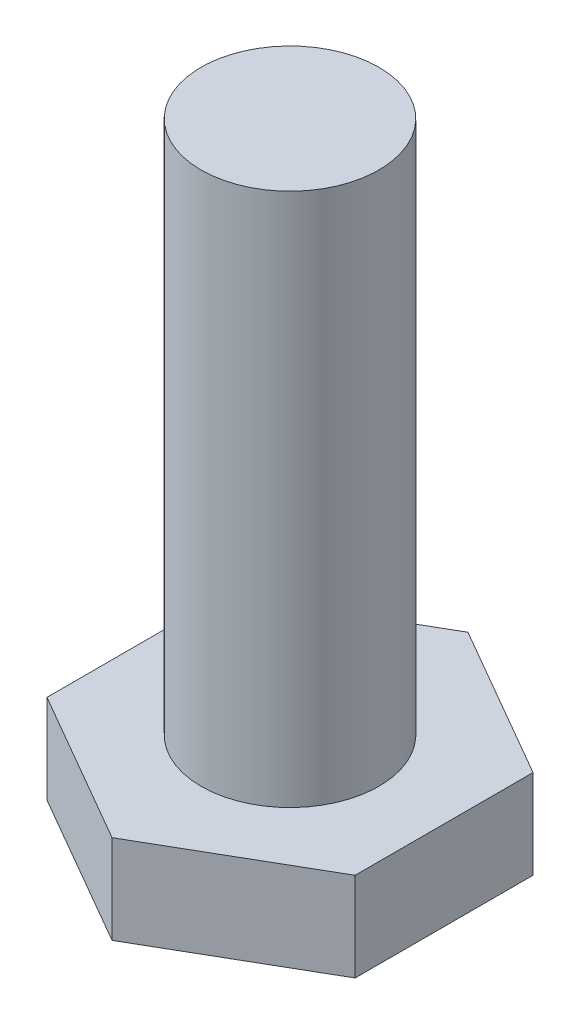
ISO-10303-21;
HEADER;
FILE_DESCRIPTION(('STEP AP214'),'2;1');
FILE_NAME('part.step','',(''),(''),'','','');
FILE_SCHEMA(('AUTOMOTIVE_DESIGN { 1 0 10303 214 1 1 1 1 }'));
ENDSEC;
DATA;
#1=APPLICATION_CONTEXT('core data for automotive mechanical design processes');
#2=APPLICATION_PROTOCOL_DEFINITION('international standard','automotive_design',2000,#1);
#3=PRODUCT_CONTEXT('',#1,'mechanical');
#4=PRODUCT('Part','Part','',(#3));
#5=PRODUCT_RELATED_PRODUCT_CATEGORY('part','',(#4));
#6=PRODUCT_DEFINITION_FORMATION('','',#4);
#7=PRODUCT_DEFINITION_CONTEXT('part definition',#1,'design');
#8=PRODUCT_DEFINITION('design','',#6,#7);
#9=PRODUCT_DEFINITION_SHAPE('','',#8);
#10=(LENGTH_UNIT() NAMED_UNIT(*) SI_UNIT(.MILLI.,.METRE.));
#11=(NAMED_UNIT(*) PLANE_ANGLE_UNIT() SI_UNIT($,.RADIAN.));
#12=(NAMED_UNIT(*) SI_UNIT($,.STERADIAN.) SOLID_ANGLE_UNIT());
#13=UNCERTAINTY_MEASURE_WITH_UNIT(LENGTH_MEASURE(1.E-05),#10,'distance_accuracy_value','');
#14=(GEOMETRIC_REPRESENTATION_CONTEXT(3) GLOBAL_UNCERTAINTY_ASSIGNED_CONTEXT((#13)) GLOBAL_UNIT_ASSIGNED_CONTEXT((#10,
#11,#12)) REPRESENTATION_CONTEXT('',''));
#15=CARTESIAN_POINT('',(0.,0.,0.));
#16=DIRECTION('',(0.,0.,1.));
#17=DIRECTION('',(1.,0.,0.));
#18=AXIS2_PLACEMENT_3D('',#15,#16,#17);
#19=CARTESIAN_POINT('',(0.,0.5,0.));
#20=DIRECTION('',(0.,1.,0.));
#21=DIRECTION('',(0.,0.,1.));
#22=AXIS2_PLACEMENT_3D('',#19,#20,#21);
#23=PLANE('',#22);
#24=CARTESIAN_POINT('',(0.,0.5,0.));
#25=DIRECTION('',(0.,1.,0.));
#26=DIRECTION('',(0.,0.,1.));
#27=AXIS2_PLACEMENT_3D('',#24,#25,#26);
#28=CIRCLE('',#27,0.5);
#29=CARTESIAN_POINT('',(0.,0.5,0.5));
#30=VERTEX_POINT('',#29);
#31=EDGE_CURVE('E39',#30,#30,#28,.T.);
#32=ORIENTED_EDGE('',*,*,#31,.F.);
#33=EDGE_LOOP('',(#32));
#34=FACE_BOUND('',#33,.T.);
#35=DIRECTION('',(0.,0.,-1.));
#36=VECTOR('',#35,1.);
#37=CARTESIAN_POINT('',(-0.866025403784439,0.5,0.));
#38=LINE('',#37,#36);
#39=CARTESIAN_POINT('',(-0.866025403784438,0.5,0.500000000000001));
#40=VERTEX_POINT('',#39);
#41=CARTESIAN_POINT('',(-0.866025403784439,0.5,-0.5));
#42=VERTEX_POINT('',#41);
#43=EDGE_CURVE('E50',#40,#42,#38,.T.);
#44=ORIENTED_EDGE('',*,*,#43,.F.);
#45=DIRECTION('',(-0.866025403784439,0.,-0.5));
#46=VECTOR('',#45,1.);
#47=CARTESIAN_POINT('',(-0.43301270189222,0.5,0.750000000000001));
#48=LINE('',#47,#46);
#49=CARTESIAN_POINT('',(0.,0.5,1.));
#50=VERTEX_POINT('',#49);
#51=EDGE_CURVE('E137',#50,#40,#48,.T.);
#52=ORIENTED_EDGE('',*,*,#51,.F.);
#53=DIRECTION('',(-0.866025403784439,0.,0.5));
#54=VECTOR('',#53,1.);
#55=CARTESIAN_POINT('',(0.43301270189222,0.5,0.750000000000001));
#56=LINE('',#55,#54);
#57=CARTESIAN_POINT('',(0.866025403784439,0.5,0.499999999999999));
#58=VERTEX_POINT('',#57);
#59=EDGE_CURVE('E134',#58,#50,#56,.T.);
#60=ORIENTED_EDGE('',*,*,#59,.F.);
#61=DIRECTION('',(0.,0.,1.));
#62=VECTOR('',#61,1.);
#63=CARTESIAN_POINT('',(0.866025403784439,0.5,0.));
#64=LINE('',#63,#62);
#65=CARTESIAN_POINT('',(0.866025403784438,0.5,-0.5));
#66=VERTEX_POINT('',#65);
#67=EDGE_CURVE('E131',#66,#58,#64,.T.);
#68=ORIENTED_EDGE('',*,*,#67,.F.);
#69=DIRECTION('',(0.866025403784439,0.,0.5));
#70=VECTOR('',#69,1.);
#71=CARTESIAN_POINT('',(0.433012701892219,0.5,-0.75));
#72=LINE('',#71,#70);
#73=CARTESIAN_POINT('',(0.,0.5,-1.));
#74=VERTEX_POINT('',#73);
#75=EDGE_CURVE('E128',#74,#66,#72,.T.);
#76=ORIENTED_EDGE('',*,*,#75,.F.);
#77=DIRECTION('',(0.866025403784439,0.,-0.5));
#78=VECTOR('',#77,1.);
#79=CARTESIAN_POINT('',(-0.433012701892219,0.5,-0.75));
#80=LINE('',#79,#78);
#81=EDGE_CURVE('E55',#42,#74,#80,.T.);
#82=ORIENTED_EDGE('',*,*,#81,.F.);
#83=EDGE_LOOP('',(#44,#52,#60,#68,#76,#82));
#84=FACE_BOUND('',#83,.T.);
#85=ADVANCED_FACE('F35',(#34,#84),#23,.T.);
#86=CARTESIAN_POINT('',(0.,3.5,0.));
#87=DIRECTION('',(0.,-1.,0.));
#88=DIRECTION('',(0.,0.,-1.));
#89=AXIS2_PLACEMENT_3D('',#86,#87,#88);
#90=CYLINDRICAL_SURFACE('',#89,0.5);
#91=CARTESIAN_POINT('',(0.,3.5,0.));
#92=DIRECTION('',(0.,1.,0.));
#93=DIRECTION('',(0.,0.,1.));
#94=AXIS2_PLACEMENT_3D('',#91,#92,#93);
#95=CIRCLE('',#94,0.5);
#96=CARTESIAN_POINT('',(0.,3.5,0.5));
#97=VERTEX_POINT('',#96);
#98=EDGE_CURVE('E11',#97,#97,#95,.T.);
#99=ORIENTED_EDGE('',*,*,#98,.F.);
#100=EDGE_LOOP('',(#99));
#101=FACE_BOUND('',#100,.T.);
#102=ORIENTED_EDGE('',*,*,#31,.T.);
#103=EDGE_LOOP('',(#102));
#104=FACE_BOUND('',#103,.T.);
#105=ADVANCED_FACE('F142',(#101,#104),#90,.T.);
#106=CARTESIAN_POINT('',(0.,3.5,0.));
#107=DIRECTION('',(0.,1.,0.));
#108=DIRECTION('',(0.,0.,1.));
#109=AXIS2_PLACEMENT_3D('',#106,#107,#108);
#110=PLANE('',#109);
#111=ORIENTED_EDGE('',*,*,#98,.T.);
#112=EDGE_LOOP('',(#111));
#113=FACE_BOUND('',#112,.T.);
#114=ADVANCED_FACE('F148',(#113),#110,.T.);
#115=CARTESIAN_POINT('',(-0.866025403784439,10.,0.));
#116=DIRECTION('',(1.,0.,0.));
#117=DIRECTION('',(0.,0.,-1.));
#118=AXIS2_PLACEMENT_3D('',#115,#116,#117);
#119=PLANE('',#118);
#120=DIRECTION('',(0.,-1.,0.));
#121=VECTOR('',#120,1.);
#122=CARTESIAN_POINT('',(-0.866025403784439,10.,0.500000000000001));
#123=LINE('',#122,#121);
#124=CARTESIAN_POINT('',(-0.866025403784439,0.,0.500000000000001));
#125=VERTEX_POINT('',#124);
#126=EDGE_CURVE('E118',#40,#125,#123,.T.);
#127=ORIENTED_EDGE('',*,*,#126,.F.);
#128=ORIENTED_EDGE('',*,*,#43,.T.);
#129=DIRECTION('',(0.,-1.,0.));
#130=VECTOR('',#129,1.);
#131=CARTESIAN_POINT('',(-0.866025403784439,10.,-0.5));
#132=LINE('',#131,#130);
#133=CARTESIAN_POINT('',(-0.866025403784439,0.,-0.5));
#134=VERTEX_POINT('',#133);
#135=EDGE_CURVE('E86',#42,#134,#132,.T.);
#136=ORIENTED_EDGE('',*,*,#135,.T.);
#137=DIRECTION('',(0.,0.,1.));
#138=VECTOR('',#137,1.);
#139=CARTESIAN_POINT('',(-0.866025403784439,0.,0.));
#140=LINE('',#139,#138);
#141=EDGE_CURVE('E91',#134,#125,#140,.T.);
#142=ORIENTED_EDGE('',*,*,#141,.T.);
#143=EDGE_LOOP('',(#127,#128,#136,#142));
#144=FACE_BOUND('',#143,.T.);
#145=ADVANCED_FACE('F89',(#144),#119,.F.);
#146=CARTESIAN_POINT('',(-0.43301270189222,10.,0.750000000000001));
#147=DIRECTION('',(0.5,0.,-0.866025403784439));
#148=DIRECTION('',(-0.866025403784439,0.,-0.5));
#149=AXIS2_PLACEMENT_3D('',#146,#147,#148);
#150=PLANE('',#149);
#151=DIRECTION('',(0.,-1.,0.));
#152=VECTOR('',#151,1.);
#153=CARTESIAN_POINT('',(0.,10.,1.));
#154=LINE('',#153,#152);
#155=CARTESIAN_POINT('',(0.,0.,1.));
#156=VERTEX_POINT('',#155);
#157=EDGE_CURVE('E120',#50,#156,#154,.T.);
#158=ORIENTED_EDGE('',*,*,#157,.F.);
#159=ORIENTED_EDGE('',*,*,#51,.T.);
#160=ORIENTED_EDGE('',*,*,#126,.T.);
#161=DIRECTION('',(0.866025403784439,0.,0.5));
#162=VECTOR('',#161,1.);
#163=CARTESIAN_POINT('',(-0.43301270189222,0.,0.750000000000001));
#164=LINE('',#163,#162);
#165=EDGE_CURVE('E95',#125,#156,#164,.T.);
#166=ORIENTED_EDGE('',*,*,#165,.T.);
#167=EDGE_LOOP('',(#158,#159,#160,#166));
#168=FACE_BOUND('',#167,.T.);
#169=ADVANCED_FACE('F157',(#168),#150,.F.);
#170=CARTESIAN_POINT('',(0.43301270189222,10.,0.750000000000001));
#171=DIRECTION('',(-0.5,0.,-0.866025403784439));
#172=DIRECTION('',(-0.866025403784439,0.,0.5));
#173=AXIS2_PLACEMENT_3D('',#170,#171,#172);
#174=PLANE('',#173);
#175=DIRECTION('',(0.,-1.,0.));
#176=VECTOR('',#175,1.);
#177=CARTESIAN_POINT('',(0.866025403784439,10.,0.500000000000001));
#178=LINE('',#177,#176);
#179=CARTESIAN_POINT('',(0.866025403784439,0.,0.500000000000001));
#180=VERTEX_POINT('',#179);
#181=EDGE_CURVE('E122',#58,#180,#178,.T.);
#182=ORIENTED_EDGE('',*,*,#181,.F.);
#183=ORIENTED_EDGE('',*,*,#59,.T.);
#184=ORIENTED_EDGE('',*,*,#157,.T.);
#185=DIRECTION('',(0.866025403784439,0.,-0.5));
#186=VECTOR('',#185,1.);
#187=CARTESIAN_POINT('',(0.43301270189222,0.,0.750000000000001));
#188=LINE('',#187,#186);
#189=EDGE_CURVE('E114',#156,#180,#188,.T.);
#190=ORIENTED_EDGE('',*,*,#189,.T.);
#191=EDGE_LOOP('',(#182,#183,#184,#190));
#192=FACE_BOUND('',#191,.T.);
#193=ADVANCED_FACE('F167',(#192),#174,.F.);
#194=CARTESIAN_POINT('',(0.866025403784439,10.,0.));
#195=DIRECTION('',(-1.,0.,0.));
#196=DIRECTION('',(0.,0.,1.));
#197=AXIS2_PLACEMENT_3D('',#194,#195,#196);
#198=PLANE('',#197);
#199=DIRECTION('',(0.,-1.,0.));
#200=VECTOR('',#199,1.);
#201=CARTESIAN_POINT('',(0.866025403784439,10.,-0.5));
#202=LINE('',#201,#200);
#203=CARTESIAN_POINT('',(0.866025403784439,0.,-0.5));
#204=VERTEX_POINT('',#203);
#205=EDGE_CURVE('E124',#66,#204,#202,.T.);
#206=ORIENTED_EDGE('',*,*,#205,.F.);
#207=ORIENTED_EDGE('',*,*,#67,.T.);
#208=ORIENTED_EDGE('',*,*,#181,.T.);
#209=DIRECTION('',(0.,0.,-1.));
#210=VECTOR('',#209,1.);
#211=CARTESIAN_POINT('',(0.866025403784439,0.,0.));
#212=LINE('',#211,#210);
#213=EDGE_CURVE('E111',#180,#204,#212,.T.);
#214=ORIENTED_EDGE('',*,*,#213,.T.);
#215=EDGE_LOOP('',(#206,#207,#208,#214));
#216=FACE_BOUND('',#215,.T.);
#217=ADVANCED_FACE('F163',(#216),#198,.F.);
#218=CARTESIAN_POINT('',(0.433012701892219,10.,-0.75));
#219=DIRECTION('',(-0.5,0.,0.866025403784439));
#220=DIRECTION('',(0.866025403784439,0.,0.5));
#221=AXIS2_PLACEMENT_3D('',#218,#219,#220);
#222=PLANE('',#221);
#223=DIRECTION('',(0.,-1.,0.));
#224=VECTOR('',#223,1.);
#225=CARTESIAN_POINT('',(0.,10.,-1.));
#226=LINE('',#225,#224);
#227=CARTESIAN_POINT('',(0.,0.,-1.));
#228=VERTEX_POINT('',#227);
#229=EDGE_CURVE('E94',#74,#228,#226,.T.);
#230=ORIENTED_EDGE('',*,*,#229,.F.);
#231=ORIENTED_EDGE('',*,*,#75,.T.);
#232=ORIENTED_EDGE('',*,*,#205,.T.);
#233=DIRECTION('',(-0.866025403784439,0.,-0.5));
#234=VECTOR('',#233,1.);
#235=CARTESIAN_POINT('',(0.433012701892219,0.,-0.75));
#236=LINE('',#235,#234);
#237=EDGE_CURVE('E104',#204,#228,#236,.T.);
#238=ORIENTED_EDGE('',*,*,#237,.T.);
#239=EDGE_LOOP('',(#230,#231,#232,#238));
#240=FACE_BOUND('',#239,.T.);
#241=ADVANCED_FACE('F160',(#240),#222,.F.);
#242=CARTESIAN_POINT('',(-0.433012701892219,10.,-0.75));
#243=DIRECTION('',(0.5,0.,0.866025403784439));
#244=DIRECTION('',(0.866025403784439,0.,-0.5));
#245=AXIS2_PLACEMENT_3D('',#242,#243,#244);
#246=PLANE('',#245);
#247=ORIENTED_EDGE('',*,*,#135,.F.);
#248=ORIENTED_EDGE('',*,*,#81,.T.);
#249=ORIENTED_EDGE('',*,*,#229,.T.);
#250=DIRECTION('',(-0.866025403784439,0.,0.5));
#251=VECTOR('',#250,1.);
#252=CARTESIAN_POINT('',(-0.433012701892219,0.,-0.75));
#253=LINE('',#252,#251);
#254=EDGE_CURVE('E99',#228,#134,#253,.T.);
#255=ORIENTED_EDGE('',*,*,#254,.T.);
#256=EDGE_LOOP('',(#247,#248,#249,#255));
#257=FACE_BOUND('',#256,.T.);
#258=ADVANCED_FACE('F100',(#257),#246,.F.);
#259=CARTESIAN_POINT('',(0.,0.,0.));
#260=DIRECTION('',(0.,1.,0.));
#261=DIRECTION('',(0.,0.,1.));
#262=AXIS2_PLACEMENT_3D('',#259,#260,#261);
#263=PLANE('',#262);
#264=ORIENTED_EDGE('',*,*,#165,.F.);
#265=ORIENTED_EDGE('',*,*,#141,.F.);
#266=ORIENTED_EDGE('',*,*,#254,.F.);
#267=ORIENTED_EDGE('',*,*,#237,.F.);
#268=ORIENTED_EDGE('',*,*,#213,.F.);
#269=ORIENTED_EDGE('',*,*,#189,.F.);
#270=EDGE_LOOP('',(#264,#265,#266,#267,#268,#269));
#271=FACE_BOUND('',#270,.T.);
#272=ADVANCED_FACE('F37',(#271),#263,.F.);
#273=CLOSED_SHELL('',(#85,#105,#114,#145,#169,#193,#217,#241,#258,#272));
#274=MANIFOLD_SOLID_BREP('B2',#273);
#275=ADVANCED_BREP_SHAPE_REPRESENTATION('',(#18,#274),#14);
#276=SHAPE_DEFINITION_REPRESENTATION(#9,#275);
ENDSEC;
END-ISO-10303-21;
